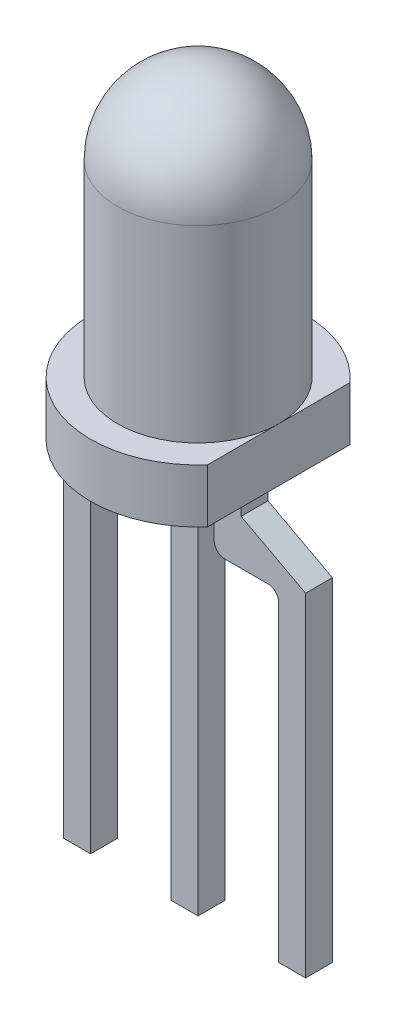
ISO-10303-21;
HEADER;
FILE_DESCRIPTION(('STEP AP214'),'2;1');
FILE_NAME('part.step','',(''),(''),'','','');
FILE_SCHEMA(('AUTOMOTIVE_DESIGN { 1 0 10303 214 1 1 1 1 }'));
ENDSEC;
DATA;
#1=APPLICATION_CONTEXT('core data for automotive mechanical design processes');
#2=APPLICATION_PROTOCOL_DEFINITION('international standard','automotive_design',2000,#1);
#3=PRODUCT_CONTEXT('',#1,'mechanical');
#4=PRODUCT('Part','Part','',(#3));
#5=PRODUCT_RELATED_PRODUCT_CATEGORY('part','',(#4));
#6=PRODUCT_DEFINITION_FORMATION('','',#4);
#7=PRODUCT_DEFINITION_CONTEXT('part definition',#1,'design');
#8=PRODUCT_DEFINITION('design','',#6,#7);
#9=PRODUCT_DEFINITION_SHAPE('','',#8);
#10=(LENGTH_UNIT() NAMED_UNIT(*) SI_UNIT(.MILLI.,.METRE.));
#11=(NAMED_UNIT(*) PLANE_ANGLE_UNIT() SI_UNIT($,.RADIAN.));
#12=(NAMED_UNIT(*) SI_UNIT($,.STERADIAN.) SOLID_ANGLE_UNIT());
#13=UNCERTAINTY_MEASURE_WITH_UNIT(LENGTH_MEASURE(1.E-05),#10,'distance_accuracy_value','');
#14=(GEOMETRIC_REPRESENTATION_CONTEXT(3) GLOBAL_UNCERTAINTY_ASSIGNED_CONTEXT((#13)) GLOBAL_UNIT_ASSIGNED_CONTEXT((#10,
#11,#12)) REPRESENTATION_CONTEXT('',''));
#15=CARTESIAN_POINT('',(0.,0.,0.));
#16=DIRECTION('',(0.,0.,1.));
#17=DIRECTION('',(1.,0.,0.));
#18=AXIS2_PLACEMENT_3D('',#15,#16,#17);
#19=CARTESIAN_POINT('',(0.,4.43,0.));
#20=DIRECTION('',(0.,1.,0.));
#21=DIRECTION('',(0.,0.,1.));
#22=AXIS2_PLACEMENT_3D('',#19,#20,#21);
#23=PLANE('',#22);
#24=DIRECTION('',(0.,0.,-1.));
#25=VECTOR('',#24,1.);
#26=CARTESIAN_POINT('',(1.5,4.43,-1.32287565553229));
#27=LINE('',#26,#25);
#28=CARTESIAN_POINT('',(1.5,4.43,1.32287565553229));
#29=VERTEX_POINT('',#28);
#30=CARTESIAN_POINT('',(1.5,4.43,0.));
#31=VERTEX_POINT('',#30);
#32=EDGE_CURVE('E410',#29,#31,#27,.T.);
#33=ORIENTED_EDGE('',*,*,#32,.T.);
#34=CARTESIAN_POINT('',(0.,4.43,0.));
#35=DIRECTION('',(0.,-1.,0.));
#36=DIRECTION('',(0.,0.,-1.));
#37=AXIS2_PLACEMENT_3D('',#34,#35,#36);
#38=CIRCLE('',#37,1.5);
#39=EDGE_CURVE('E47',#31,#31,#38,.T.);
#40=ORIENTED_EDGE('',*,*,#39,.T.);
#41=CARTESIAN_POINT('',(1.5,4.43,-1.32287565553229));
#42=VERTEX_POINT('',#41);
#43=EDGE_CURVE('E408',#31,#42,#27,.T.);
#44=ORIENTED_EDGE('',*,*,#43,.T.);
#45=CARTESIAN_POINT('',(0.,4.43,0.));
#46=DIRECTION('',(0.,1.,0.));
#47=DIRECTION('',(0.,0.,1.));
#48=AXIS2_PLACEMENT_3D('',#45,#46,#47);
#49=CIRCLE('',#48,2.);
#50=EDGE_CURVE('E405',#42,#29,#49,.T.);
#51=ORIENTED_EDGE('',*,*,#50,.T.);
#52=EDGE_LOOP('',(#33,#40,#44,#51));
#53=FACE_BOUND('',#52,.T.);
#54=ADVANCED_FACE('F32',(#53),#23,.T.);
#55=CARTESIAN_POINT('',(0.250000000000001,-4.,-0.249999999999998));
#56=DIRECTION('',(1.,0.,0.));
#57=DIRECTION('',(0.,0.,-1.));
#58=AXIS2_PLACEMENT_3D('',#55,#56,#57);
#59=PLANE('',#58);
#60=DIRECTION('',(0.,1.,0.));
#61=VECTOR('',#60,1.);
#62=CARTESIAN_POINT('',(0.250000000000001,-4.,-0.249999999999998));
#63=LINE('',#62,#61);
#64=CARTESIAN_POINT('',(0.250000000000001,-4.,-0.249999999999998));
#65=VERTEX_POINT('',#64);
#66=CARTESIAN_POINT('',(0.250000000000002,3.43,-0.249999999999998));
#67=VERTEX_POINT('',#66);
#68=EDGE_CURVE('E36',#65,#67,#63,.T.);
#69=ORIENTED_EDGE('',*,*,#68,.T.);
#70=DIRECTION('',(0.,0.,1.));
#71=VECTOR('',#70,1.);
#72=CARTESIAN_POINT('',(0.250000000000002,3.43,-3.2156196654325));
#73=LINE('',#72,#71);
#74=CARTESIAN_POINT('',(0.250000000000002,3.43,0.250000000000003));
#75=VERTEX_POINT('',#74);
#76=EDGE_CURVE('E425',#67,#75,#73,.T.);
#77=ORIENTED_EDGE('',*,*,#76,.T.);
#78=DIRECTION('',(0.,1.,0.));
#79=VECTOR('',#78,1.);
#80=CARTESIAN_POINT('',(0.250000000000002,-4.,0.250000000000003));
#81=LINE('',#80,#79);
#82=CARTESIAN_POINT('',(0.250000000000002,-4.,0.250000000000003));
#83=VERTEX_POINT('',#82);
#84=EDGE_CURVE('E11',#83,#75,#81,.T.);
#85=ORIENTED_EDGE('',*,*,#84,.F.);
#86=DIRECTION('',(0.,0.,-1.));
#87=VECTOR('',#86,1.);
#88=CARTESIAN_POINT('',(0.250000000000001,-4.,-0.249999999999998));
#89=LINE('',#88,#87);
#90=EDGE_CURVE('E432',#83,#65,#89,.T.);
#91=ORIENTED_EDGE('',*,*,#90,.T.);
#92=EDGE_LOOP('',(#69,#77,#85,#91));
#93=FACE_BOUND('',#92,.T.);
#94=ADVANCED_FACE('F34',(#93),#59,.T.);
#95=CARTESIAN_POINT('',(-0.249999999999998,-4.,0.250000000000003));
#96=DIRECTION('',(0.,0.,1.));
#97=DIRECTION('',(1.,0.,0.));
#98=AXIS2_PLACEMENT_3D('',#95,#96,#97);
#99=PLANE('',#98);
#100=ORIENTED_EDGE('',*,*,#84,.T.);
#101=DIRECTION('',(-1.,0.,0.));
#102=VECTOR('',#101,1.);
#103=CARTESIAN_POINT('',(-0.249999999999998,3.43,0.250000000000003));
#104=LINE('',#103,#102);
#105=CARTESIAN_POINT('',(-0.249999999999998,3.43,0.250000000000003));
#106=VERTEX_POINT('',#105);
#107=EDGE_CURVE('E422',#75,#106,#104,.T.);
#108=ORIENTED_EDGE('',*,*,#107,.T.);
#109=DIRECTION('',(0.,1.,0.));
#110=VECTOR('',#109,1.);
#111=CARTESIAN_POINT('',(-0.249999999999998,-4.,0.250000000000003));
#112=LINE('',#111,#110);
#113=CARTESIAN_POINT('',(-0.249999999999998,-4.,0.250000000000003));
#114=VERTEX_POINT('',#113);
#115=EDGE_CURVE('E41',#114,#106,#112,.T.);
#116=ORIENTED_EDGE('',*,*,#115,.F.);
#117=DIRECTION('',(1.,0.,0.));
#118=VECTOR('',#117,1.);
#119=CARTESIAN_POINT('',(-0.249999999999998,-4.,0.250000000000003));
#120=LINE('',#119,#118);
#121=EDGE_CURVE('E443',#114,#83,#120,.T.);
#122=ORIENTED_EDGE('',*,*,#121,.T.);
#123=EDGE_LOOP('',(#100,#108,#116,#122));
#124=FACE_BOUND('',#123,.T.);
#125=ADVANCED_FACE('F460',(#124),#99,.T.);
#126=CARTESIAN_POINT('',(-0.249999999999999,-4.,-0.249999999999998));
#127=DIRECTION('',(-1.,0.,0.));
#128=DIRECTION('',(0.,0.,1.));
#129=AXIS2_PLACEMENT_3D('',#126,#127,#128);
#130=PLANE('',#129);
#131=ORIENTED_EDGE('',*,*,#115,.T.);
#132=DIRECTION('',(0.,0.,1.));
#133=VECTOR('',#132,1.);
#134=CARTESIAN_POINT('',(-0.249999999999998,3.43,-3.2156196654325));
#135=LINE('',#134,#133);
#136=CARTESIAN_POINT('',(-0.249999999999999,3.43,-0.249999999999998));
#137=VERTEX_POINT('',#136);
#138=EDGE_CURVE('E429',#137,#106,#135,.T.);
#139=ORIENTED_EDGE('',*,*,#138,.F.);
#140=DIRECTION('',(0.,1.,0.));
#141=VECTOR('',#140,1.);
#142=CARTESIAN_POINT('',(-0.249999999999999,-4.,-0.249999999999998));
#143=LINE('',#142,#141);
#144=CARTESIAN_POINT('',(-0.249999999999999,-4.,-0.249999999999998));
#145=VERTEX_POINT('',#144);
#146=EDGE_CURVE('E446',#145,#137,#143,.T.);
#147=ORIENTED_EDGE('',*,*,#146,.F.);
#148=DIRECTION('',(0.,0.,1.));
#149=VECTOR('',#148,1.);
#150=CARTESIAN_POINT('',(-0.249999999999999,-4.,-0.249999999999998));
#151=LINE('',#150,#149);
#152=EDGE_CURVE('E440',#145,#114,#151,.T.);
#153=ORIENTED_EDGE('',*,*,#152,.T.);
#154=EDGE_LOOP('',(#131,#139,#147,#153));
#155=FACE_BOUND('',#154,.T.);
#156=ADVANCED_FACE('F466',(#155),#130,.T.);
#157=CARTESIAN_POINT('',(-0.249999999999999,-4.,-0.249999999999998));
#158=DIRECTION('',(0.,0.,-1.));
#159=DIRECTION('',(-1.,0.,0.));
#160=AXIS2_PLACEMENT_3D('',#157,#158,#159);
#161=PLANE('',#160);
#162=ORIENTED_EDGE('',*,*,#146,.T.);
#163=DIRECTION('',(-1.,0.,0.));
#164=VECTOR('',#163,1.);
#165=CARTESIAN_POINT('',(-0.249999999999998,3.43,-0.249999999999998));
#166=LINE('',#165,#164);
#167=EDGE_CURVE('E426',#67,#137,#166,.T.);
#168=ORIENTED_EDGE('',*,*,#167,.F.);
#169=ORIENTED_EDGE('',*,*,#68,.F.);
#170=DIRECTION('',(-1.,0.,0.));
#171=VECTOR('',#170,1.);
#172=CARTESIAN_POINT('',(-0.249999999999999,-4.,-0.249999999999998));
#173=LINE('',#172,#171);
#174=EDGE_CURVE('E437',#65,#145,#173,.T.);
#175=ORIENTED_EDGE('',*,*,#174,.T.);
#176=EDGE_LOOP('',(#162,#168,#169,#175));
#177=FACE_BOUND('',#176,.T.);
#178=ADVANCED_FACE('F455',(#177),#161,.T.);
#179=CARTESIAN_POINT('',(0.250000000000002,-4.,0.250000000000003));
#180=DIRECTION('',(0.,1.,0.));
#181=DIRECTION('',(0.,0.,1.));
#182=AXIS2_PLACEMENT_3D('',#179,#180,#181);
#183=PLANE('',#182);
#184=ORIENTED_EDGE('',*,*,#90,.F.);
#185=ORIENTED_EDGE('',*,*,#121,.F.);
#186=ORIENTED_EDGE('',*,*,#152,.F.);
#187=ORIENTED_EDGE('',*,*,#174,.F.);
#188=EDGE_LOOP('',(#184,#185,#186,#187));
#189=FACE_BOUND('',#188,.T.);
#190=ADVANCED_FACE('F463',(#189),#183,.F.);
#191=CARTESIAN_POINT('',(0.,4.43,0.));
#192=DIRECTION('',(0.,-1.,0.));
#193=DIRECTION('',(0.,0.,-1.));
#194=AXIS2_PLACEMENT_3D('',#191,#192,#193);
#195=CYLINDRICAL_SURFACE('',#194,2.);
#196=CARTESIAN_POINT('',(0.,3.43,0.));
#197=DIRECTION('',(0.,1.,0.));
#198=DIRECTION('',(0.,0.,1.));
#199=AXIS2_PLACEMENT_3D('',#196,#197,#198);
#200=CIRCLE('',#199,2.);
#201=CARTESIAN_POINT('',(1.5,3.43,-1.32287565553229));
#202=VERTEX_POINT('',#201);
#203=CARTESIAN_POINT('',(1.5,3.43,1.32287565553229));
#204=VERTEX_POINT('',#203);
#205=EDGE_CURVE('E399',#202,#204,#200,.T.);
#206=ORIENTED_EDGE('',*,*,#205,.T.);
#207=DIRECTION('',(0.,-1.,0.));
#208=VECTOR('',#207,1.);
#209=CARTESIAN_POINT('',(1.5,4.43,1.32287565553229));
#210=LINE('',#209,#208);
#211=EDGE_CURVE('E419',#29,#204,#210,.T.);
#212=ORIENTED_EDGE('',*,*,#211,.F.);
#213=ORIENTED_EDGE('',*,*,#50,.F.);
#214=DIRECTION('',(0.,-1.,0.));
#215=VECTOR('',#214,1.);
#216=CARTESIAN_POINT('',(1.5,4.43,-1.32287565553229));
#217=LINE('',#216,#215);
#218=EDGE_CURVE('E413',#42,#202,#217,.T.);
#219=ORIENTED_EDGE('',*,*,#218,.T.);
#220=EDGE_LOOP('',(#206,#212,#213,#219));
#221=FACE_BOUND('',#220,.T.);
#222=ADVANCED_FACE('F490',(#221),#195,.T.);
#223=CARTESIAN_POINT('',(1.5,4.43,-1.32287565553229));
#224=DIRECTION('',(-1.,0.,0.));
#225=DIRECTION('',(0.,0.,1.));
#226=AXIS2_PLACEMENT_3D('',#223,#224,#225);
#227=PLANE('',#226);
#228=DIRECTION('',(0.,0.,-1.));
#229=VECTOR('',#228,1.);
#230=CARTESIAN_POINT('',(1.5,3.43,-1.32287565553229));
#231=LINE('',#230,#229);
#232=EDGE_CURVE('E409',#204,#202,#231,.T.);
#233=ORIENTED_EDGE('',*,*,#232,.T.);
#234=ORIENTED_EDGE('',*,*,#218,.F.);
#235=ORIENTED_EDGE('',*,*,#43,.F.);
#236=ORIENTED_EDGE('',*,*,#32,.F.);
#237=ORIENTED_EDGE('',*,*,#211,.T.);
#238=EDGE_LOOP('',(#233,#234,#235,#236,#237));
#239=FACE_BOUND('',#238,.T.);
#240=ADVANCED_FACE('F486',(#239),#227,.F.);
#241=CARTESIAN_POINT('',(0.,3.43,0.));
#242=DIRECTION('',(0.,1.,0.));
#243=DIRECTION('',(0.,0.,1.));
#244=AXIS2_PLACEMENT_3D('',#241,#242,#243);
#245=PLANE('',#244);
#246=DIRECTION('',(-1.,0.,0.));
#247=VECTOR('',#246,1.);
#248=CARTESIAN_POINT('',(-0.55,3.43,0.250000000000003));
#249=LINE('',#248,#247);
#250=CARTESIAN_POINT('',(-0.55,3.43,0.250000000000003));
#251=VERTEX_POINT('',#250);
#252=CARTESIAN_POINT('',(-1.05,3.43,0.250000000000003));
#253=VERTEX_POINT('',#252);
#254=EDGE_CURVE('E240',#251,#253,#249,.T.);
#255=ORIENTED_EDGE('',*,*,#254,.F.);
#256=DIRECTION('',(0.,0.,1.));
#257=VECTOR('',#256,1.);
#258=CARTESIAN_POINT('',(-0.55,3.43,-3.2156196654325));
#259=LINE('',#258,#257);
#260=CARTESIAN_POINT('',(-0.55,3.43,-0.249999999999998));
#261=VERTEX_POINT('',#260);
#262=EDGE_CURVE('E273',#261,#251,#259,.T.);
#263=ORIENTED_EDGE('',*,*,#262,.F.);
#264=DIRECTION('',(-1.,0.,0.));
#265=VECTOR('',#264,1.);
#266=CARTESIAN_POINT('',(-0.55,3.43,-0.249999999999998));
#267=LINE('',#266,#265);
#268=CARTESIAN_POINT('',(-1.05,3.43,-0.249999999999998));
#269=VERTEX_POINT('',#268);
#270=EDGE_CURVE('E270',#261,#269,#267,.T.);
#271=ORIENTED_EDGE('',*,*,#270,.T.);
#272=DIRECTION('',(0.,0.,1.));
#273=VECTOR('',#272,1.);
#274=CARTESIAN_POINT('',(-1.05,3.43,-3.2156196654325));
#275=LINE('',#274,#273);
#276=EDGE_CURVE('E269',#269,#253,#275,.T.);
#277=ORIENTED_EDGE('',*,*,#276,.T.);
#278=EDGE_LOOP('',(#255,#263,#271,#277));
#279=FACE_BOUND('',#278,.T.);
#280=DIRECTION('',(-1.,0.,0.));
#281=VECTOR('',#280,1.);
#282=CARTESIAN_POINT('',(0.55,3.43,0.250000000000003));
#283=LINE('',#282,#281);
#284=CARTESIAN_POINT('',(1.05,3.43,0.250000000000003));
#285=VERTEX_POINT('',#284);
#286=CARTESIAN_POINT('',(0.55,3.43,0.250000000000003));
#287=VERTEX_POINT('',#286);
#288=EDGE_CURVE('E338',#285,#287,#283,.T.);
#289=ORIENTED_EDGE('',*,*,#288,.F.);
#290=DIRECTION('',(0.,0.,1.));
#291=VECTOR('',#290,1.);
#292=CARTESIAN_POINT('',(1.05,3.43,-3.2156196654325));
#293=LINE('',#292,#291);
#294=CARTESIAN_POINT('',(1.05,3.43,-0.249999999999998));
#295=VERTEX_POINT('',#294);
#296=EDGE_CURVE('E365',#295,#285,#293,.T.);
#297=ORIENTED_EDGE('',*,*,#296,.F.);
#298=DIRECTION('',(-1.,0.,0.));
#299=VECTOR('',#298,1.);
#300=CARTESIAN_POINT('',(0.55,3.43,-0.249999999999998));
#301=LINE('',#300,#299);
#302=CARTESIAN_POINT('',(0.55,3.43,-0.249999999999998));
#303=VERTEX_POINT('',#302);
#304=EDGE_CURVE('E362',#295,#303,#301,.T.);
#305=ORIENTED_EDGE('',*,*,#304,.T.);
#306=DIRECTION('',(0.,0.,1.));
#307=VECTOR('',#306,1.);
#308=CARTESIAN_POINT('',(0.55,3.43,-3.2156196654325));
#309=LINE('',#308,#307);
#310=EDGE_CURVE('E361',#303,#287,#309,.T.);
#311=ORIENTED_EDGE('',*,*,#310,.T.);
#312=EDGE_LOOP('',(#289,#297,#305,#311));
#313=FACE_BOUND('',#312,.T.);
#314=ORIENTED_EDGE('',*,*,#76,.F.);
#315=ORIENTED_EDGE('',*,*,#167,.T.);
#316=ORIENTED_EDGE('',*,*,#138,.T.);
#317=ORIENTED_EDGE('',*,*,#107,.F.);
#318=EDGE_LOOP('',(#314,#315,#316,#317));
#319=FACE_BOUND('',#318,.T.);
#320=ORIENTED_EDGE('',*,*,#205,.F.);
#321=ORIENTED_EDGE('',*,*,#232,.F.);
#322=EDGE_LOOP('',(#320,#321));
#323=FACE_BOUND('',#322,.T.);
#324=ADVANCED_FACE('F457',(#279,#313,#319,#323),#245,.F.);
#325=CARTESIAN_POINT('',(2.25,-4.,-0.249999999999997));
#326=DIRECTION('',(1.,0.,0.));
#327=DIRECTION('',(0.,0.,-1.));
#328=AXIS2_PLACEMENT_3D('',#325,#326,#327);
#329=PLANE('',#328);
#330=DIRECTION('',(0.,1.,0.));
#331=VECTOR('',#330,1.);
#332=CARTESIAN_POINT('',(2.25,-4.,-0.249999999999997));
#333=LINE('',#332,#331);
#334=CARTESIAN_POINT('',(2.25,-4.,-0.249999999999997));
#335=VERTEX_POINT('',#334);
#336=CARTESIAN_POINT('',(2.25,2.2,-0.249999999999998));
#337=VERTEX_POINT('',#336);
#338=EDGE_CURVE('E396',#335,#337,#333,.T.);
#339=ORIENTED_EDGE('',*,*,#338,.T.);
#340=DIRECTION('',(0.,0.,1.));
#341=VECTOR('',#340,1.);
#342=CARTESIAN_POINT('',(2.25,2.2,-3.2156196654325));
#343=LINE('',#342,#341);
#344=CARTESIAN_POINT('',(2.25,2.2,0.250000000000003));
#345=VERTEX_POINT('',#344);
#346=EDGE_CURVE('E328',#337,#345,#343,.T.);
#347=ORIENTED_EDGE('',*,*,#346,.T.);
#348=DIRECTION('',(0.,1.,0.));
#349=VECTOR('',#348,1.);
#350=CARTESIAN_POINT('',(2.25,-4.,0.250000000000003));
#351=LINE('',#350,#349);
#352=CARTESIAN_POINT('',(2.25,-4.,0.250000000000003));
#353=VERTEX_POINT('',#352);
#354=EDGE_CURVE('E397',#353,#345,#351,.T.);
#355=ORIENTED_EDGE('',*,*,#354,.F.);
#356=DIRECTION('',(0.,0.,-1.));
#357=VECTOR('',#356,1.);
#358=CARTESIAN_POINT('',(2.25,-4.,-0.249999999999997));
#359=LINE('',#358,#357);
#360=EDGE_CURVE('E375',#353,#335,#359,.T.);
#361=ORIENTED_EDGE('',*,*,#360,.T.);
#362=EDGE_LOOP('',(#339,#347,#355,#361));
#363=FACE_BOUND('',#362,.T.);
#364=ADVANCED_FACE('F482',(#363),#329,.T.);
#365=CARTESIAN_POINT('',(1.75,-4.,0.250000000000003));
#366=DIRECTION('',(0.,0.,1.));
#367=DIRECTION('',(1.,0.,0.));
#368=AXIS2_PLACEMENT_3D('',#365,#366,#367);
#369=PLANE('',#368);
#370=ORIENTED_EDGE('',*,*,#354,.T.);
#371=DIRECTION('',(-0.882760707440721,0.469822874495014,0.));
#372=VECTOR('',#371,1.);
#373=CARTESIAN_POINT('',(1.05,2.8386639602804,0.250000000000003));
#374=LINE('',#373,#372);
#375=CARTESIAN_POINT('',(1.05,2.8386639602804,0.250000000000003));
#376=VERTEX_POINT('',#375);
#377=EDGE_CURVE('E319',#345,#376,#374,.T.);
#378=ORIENTED_EDGE('',*,*,#377,.T.);
#379=DIRECTION('',(0.,1.,0.));
#380=VECTOR('',#379,1.);
#381=CARTESIAN_POINT('',(1.05,3.43,0.250000000000003));
#382=LINE('',#381,#380);
#383=EDGE_CURVE('E340',#376,#285,#382,.T.);
#384=ORIENTED_EDGE('',*,*,#383,.T.);
#385=ORIENTED_EDGE('',*,*,#288,.T.);
#386=DIRECTION('',(0.,-1.,0.));
#387=VECTOR('',#386,1.);
#388=CARTESIAN_POINT('',(0.55,2.2,0.250000000000003));
#389=LINE('',#388,#387);
#390=CARTESIAN_POINT('',(0.55,2.2,0.250000000000003));
#391=VERTEX_POINT('',#390);
#392=EDGE_CURVE('E335',#287,#391,#389,.T.);
#393=ORIENTED_EDGE('',*,*,#392,.T.);
#394=CARTESIAN_POINT('',(0.75,2.2,0.250000000000003));
#395=DIRECTION('',(0.,0.,1.));
#396=DIRECTION('',(-1.,0.,0.));
#397=AXIS2_PLACEMENT_3D('',#394,#395,#396);
#398=CIRCLE('',#397,0.2);
#399=CARTESIAN_POINT('',(0.75,2.,0.250000000000003));
#400=VERTEX_POINT('',#399);
#401=EDGE_CURVE('E332',#391,#400,#398,.T.);
#402=ORIENTED_EDGE('',*,*,#401,.T.);
#403=DIRECTION('',(1.,0.,0.));
#404=VECTOR('',#403,1.);
#405=CARTESIAN_POINT('',(1.55,2.,0.250000000000003));
#406=LINE('',#405,#404);
#407=CARTESIAN_POINT('',(1.55,2.,0.250000000000003));
#408=VERTEX_POINT('',#407);
#409=EDGE_CURVE('E329',#400,#408,#406,.T.);
#410=ORIENTED_EDGE('',*,*,#409,.T.);
#411=CARTESIAN_POINT('',(1.55,1.8,0.250000000000003));
#412=DIRECTION('',(0.,0.,-1.));
#413=DIRECTION('',(1.,0.,0.));
#414=AXIS2_PLACEMENT_3D('',#411,#412,#413);
#415=CIRCLE('',#414,0.2);
#416=CARTESIAN_POINT('',(1.75,1.8,0.250000000000003));
#417=VERTEX_POINT('',#416);
#418=EDGE_CURVE('E325',#408,#417,#415,.T.);
#419=ORIENTED_EDGE('',*,*,#418,.T.);
#420=DIRECTION('',(0.,1.,0.));
#421=VECTOR('',#420,1.);
#422=CARTESIAN_POINT('',(1.75,-4.,0.250000000000003));
#423=LINE('',#422,#421);
#424=CARTESIAN_POINT('',(1.75,-4.,0.250000000000003));
#425=VERTEX_POINT('',#424);
#426=EDGE_CURVE('E400',#425,#417,#423,.T.);
#427=ORIENTED_EDGE('',*,*,#426,.F.);
#428=DIRECTION('',(1.,0.,0.));
#429=VECTOR('',#428,1.);
#430=CARTESIAN_POINT('',(1.75,-4.,0.250000000000003));
#431=LINE('',#430,#429);
#432=EDGE_CURVE('E393',#425,#353,#431,.T.);
#433=ORIENTED_EDGE('',*,*,#432,.T.);
#434=EDGE_LOOP('',(#370,#378,#384,#385,#393,#402,#410,#419,#427,#433));
#435=FACE_BOUND('',#434,.T.);
#436=ADVANCED_FACE('F520',(#435),#369,.T.);
#437=CARTESIAN_POINT('',(1.75,-4.,-0.249999999999997));
#438=DIRECTION('',(-1.,0.,0.));
#439=DIRECTION('',(0.,0.,1.));
#440=AXIS2_PLACEMENT_3D('',#437,#438,#439);
#441=PLANE('',#440);
#442=ORIENTED_EDGE('',*,*,#426,.T.);
#443=DIRECTION('',(0.,0.,1.));
#444=VECTOR('',#443,1.);
#445=CARTESIAN_POINT('',(1.75,1.8,-3.2156196654325));
#446=LINE('',#445,#444);
#447=CARTESIAN_POINT('',(1.75,1.8,-0.249999999999998));
#448=VERTEX_POINT('',#447);
#449=EDGE_CURVE('E348',#448,#417,#446,.T.);
#450=ORIENTED_EDGE('',*,*,#449,.F.);
#451=DIRECTION('',(0.,1.,0.));
#452=VECTOR('',#451,1.);
#453=CARTESIAN_POINT('',(1.75,-4.,-0.249999999999997));
#454=LINE('',#453,#452);
#455=CARTESIAN_POINT('',(1.75,-4.,-0.249999999999997));
#456=VERTEX_POINT('',#455);
#457=EDGE_CURVE('E402',#456,#448,#454,.T.);
#458=ORIENTED_EDGE('',*,*,#457,.F.);
#459=DIRECTION('',(0.,0.,1.));
#460=VECTOR('',#459,1.);
#461=CARTESIAN_POINT('',(1.75,-4.,-0.249999999999997));
#462=LINE('',#461,#460);
#463=EDGE_CURVE('E390',#456,#425,#462,.T.);
#464=ORIENTED_EDGE('',*,*,#463,.T.);
#465=EDGE_LOOP('',(#442,#450,#458,#464));
#466=FACE_BOUND('',#465,.T.);
#467=ADVANCED_FACE('F527',(#466),#441,.T.);
#468=CARTESIAN_POINT('',(1.75,-4.,-0.249999999999997));
#469=DIRECTION('',(0.,0.,-1.));
#470=DIRECTION('',(-1.,0.,0.));
#471=AXIS2_PLACEMENT_3D('',#468,#469,#470);
#472=PLANE('',#471);
#473=ORIENTED_EDGE('',*,*,#457,.T.);
#474=CARTESIAN_POINT('',(1.55,1.8,-0.249999999999998));
#475=DIRECTION('',(0.,0.,-1.));
#476=DIRECTION('',(-1.,0.,0.));
#477=AXIS2_PLACEMENT_3D('',#474,#475,#476);
#478=CIRCLE('',#477,0.2);
#479=CARTESIAN_POINT('',(1.55,2.,-0.249999999999998));
#480=VERTEX_POINT('',#479);
#481=EDGE_CURVE('E345',#480,#448,#478,.T.);
#482=ORIENTED_EDGE('',*,*,#481,.F.);
#483=DIRECTION('',(1.,0.,0.));
#484=VECTOR('',#483,1.);
#485=CARTESIAN_POINT('',(1.55,2.,-0.249999999999998));
#486=LINE('',#485,#484);
#487=CARTESIAN_POINT('',(0.75,2.,-0.249999999999998));
#488=VERTEX_POINT('',#487);
#489=EDGE_CURVE('E350',#488,#480,#486,.T.);
#490=ORIENTED_EDGE('',*,*,#489,.F.);
#491=CARTESIAN_POINT('',(0.75,2.2,-0.249999999999998));
#492=DIRECTION('',(0.,0.,-1.));
#493=DIRECTION('',(-1.,0.,0.));
#494=AXIS2_PLACEMENT_3D('',#491,#492,#493);
#495=CIRCLE('',#494,0.2);
#496=CARTESIAN_POINT('',(0.55,2.2,-0.249999999999998));
#497=VERTEX_POINT('',#496);
#498=EDGE_CURVE('E354',#497,#488,#495,.F.);
#499=ORIENTED_EDGE('',*,*,#498,.F.);
#500=DIRECTION('',(0.,-1.,0.));
#501=VECTOR('',#500,1.);
#502=CARTESIAN_POINT('',(0.55,2.2,-0.249999999999998));
#503=LINE('',#502,#501);
#504=EDGE_CURVE('E358',#303,#497,#503,.T.);
#505=ORIENTED_EDGE('',*,*,#504,.F.);
#506=ORIENTED_EDGE('',*,*,#304,.F.);
#507=DIRECTION('',(0.,1.,0.));
#508=VECTOR('',#507,1.);
#509=CARTESIAN_POINT('',(1.05,3.43,-0.249999999999998));
#510=LINE('',#509,#508);
#511=CARTESIAN_POINT('',(1.05,2.8386639602804,-0.249999999999998));
#512=VERTEX_POINT('',#511);
#513=EDGE_CURVE('E366',#512,#295,#510,.T.);
#514=ORIENTED_EDGE('',*,*,#513,.F.);
#515=DIRECTION('',(-0.882760707440721,0.469822874495014,0.));
#516=VECTOR('',#515,1.);
#517=CARTESIAN_POINT('',(1.05,2.8386639602804,-0.249999999999998));
#518=LINE('',#517,#516);
#519=EDGE_CURVE('E370',#337,#512,#518,.T.);
#520=ORIENTED_EDGE('',*,*,#519,.F.);
#521=ORIENTED_EDGE('',*,*,#338,.F.);
#522=DIRECTION('',(-1.,0.,0.));
#523=VECTOR('',#522,1.);
#524=CARTESIAN_POINT('',(1.75,-4.,-0.249999999999997));
#525=LINE('',#524,#523);
#526=EDGE_CURVE('E387',#335,#456,#525,.T.);
#527=ORIENTED_EDGE('',*,*,#526,.T.);
#528=EDGE_LOOP('',(#473,#482,#490,#499,#505,#506,#514,#520,#521,#527));
#529=FACE_BOUND('',#528,.T.);
#530=ADVANCED_FACE('F535',(#529),#472,.T.);
#531=CARTESIAN_POINT('',(2.25,-4.,0.250000000000003));
#532=DIRECTION('',(0.,1.,0.));
#533=DIRECTION('',(0.,0.,1.));
#534=AXIS2_PLACEMENT_3D('',#531,#532,#533);
#535=PLANE('',#534);
#536=ORIENTED_EDGE('',*,*,#360,.F.);
#537=ORIENTED_EDGE('',*,*,#432,.F.);
#538=ORIENTED_EDGE('',*,*,#463,.F.);
#539=ORIENTED_EDGE('',*,*,#526,.F.);
#540=EDGE_LOOP('',(#536,#537,#538,#539));
#541=FACE_BOUND('',#540,.T.);
#542=ADVANCED_FACE('F543',(#541),#535,.F.);
#543=CARTESIAN_POINT('',(1.05,2.8386639602804,-3.2156196654325));
#544=DIRECTION('',(0.469822874495014,0.882760707440721,0.));
#545=DIRECTION('',(-0.882760707440721,0.469822874495014,0.));
#546=AXIS2_PLACEMENT_3D('',#543,#544,#545);
#547=PLANE('',#546);
#548=ORIENTED_EDGE('',*,*,#346,.F.);
#549=ORIENTED_EDGE('',*,*,#519,.T.);
#550=DIRECTION('',(0.,0.,1.));
#551=VECTOR('',#550,1.);
#552=CARTESIAN_POINT('',(1.05,2.8386639602804,-3.2156196654325));
#553=LINE('',#552,#551);
#554=EDGE_CURVE('E369',#512,#376,#553,.T.);
#555=ORIENTED_EDGE('',*,*,#554,.T.);
#556=ORIENTED_EDGE('',*,*,#377,.F.);
#557=EDGE_LOOP('',(#548,#549,#555,#556));
#558=FACE_BOUND('',#557,.T.);
#559=ADVANCED_FACE('F550',(#558),#547,.T.);
#560=CARTESIAN_POINT('',(1.05,3.43,-3.2156196654325));
#561=DIRECTION('',(1.,0.,0.));
#562=DIRECTION('',(0.,1.,0.));
#563=AXIS2_PLACEMENT_3D('',#560,#561,#562);
#564=PLANE('',#563);
#565=ORIENTED_EDGE('',*,*,#554,.F.);
#566=ORIENTED_EDGE('',*,*,#513,.T.);
#567=ORIENTED_EDGE('',*,*,#296,.T.);
#568=ORIENTED_EDGE('',*,*,#383,.F.);
#569=EDGE_LOOP('',(#565,#566,#567,#568));
#570=FACE_BOUND('',#569,.T.);
#571=ADVANCED_FACE('F558',(#570),#564,.T.);
#572=CARTESIAN_POINT('',(0.55,2.2,-3.2156196654325));
#573=DIRECTION('',(-1.,0.,0.));
#574=DIRECTION('',(0.,0.,1.));
#575=AXIS2_PLACEMENT_3D('',#572,#573,#574);
#576=PLANE('',#575);
#577=ORIENTED_EDGE('',*,*,#310,.F.);
#578=ORIENTED_EDGE('',*,*,#504,.T.);
#579=DIRECTION('',(0.,0.,1.));
#580=VECTOR('',#579,1.);
#581=CARTESIAN_POINT('',(0.55,2.2,-3.2156196654325));
#582=LINE('',#581,#580);
#583=EDGE_CURVE('E357',#497,#391,#582,.T.);
#584=ORIENTED_EDGE('',*,*,#583,.T.);
#585=ORIENTED_EDGE('',*,*,#392,.F.);
#586=EDGE_LOOP('',(#577,#578,#584,#585));
#587=FACE_BOUND('',#586,.T.);
#588=ADVANCED_FACE('F566',(#587),#576,.T.);
#589=CARTESIAN_POINT('',(0.75,2.2,-3.2156196654325));
#590=DIRECTION('',(0.,0.,1.));
#591=DIRECTION('',(1.,0.,0.));
#592=AXIS2_PLACEMENT_3D('',#589,#590,#591);
#593=CYLINDRICAL_SURFACE('',#592,0.2);
#594=ORIENTED_EDGE('',*,*,#583,.F.);
#595=ORIENTED_EDGE('',*,*,#498,.T.);
#596=DIRECTION('',(0.,0.,1.));
#597=VECTOR('',#596,1.);
#598=CARTESIAN_POINT('',(0.75,2.,-3.2156196654325));
#599=LINE('',#598,#597);
#600=EDGE_CURVE('E353',#488,#400,#599,.T.);
#601=ORIENTED_EDGE('',*,*,#600,.T.);
#602=ORIENTED_EDGE('',*,*,#401,.F.);
#603=EDGE_LOOP('',(#594,#595,#601,#602));
#604=FACE_BOUND('',#603,.T.);
#605=ADVANCED_FACE('F574',(#604),#593,.T.);
#606=CARTESIAN_POINT('',(1.55,2.,-3.2156196654325));
#607=DIRECTION('',(0.,-1.,0.));
#608=DIRECTION('',(0.,0.,-1.));
#609=AXIS2_PLACEMENT_3D('',#606,#607,#608);
#610=PLANE('',#609);
#611=ORIENTED_EDGE('',*,*,#600,.F.);
#612=ORIENTED_EDGE('',*,*,#489,.T.);
#613=DIRECTION('',(0.,0.,1.));
#614=VECTOR('',#613,1.);
#615=CARTESIAN_POINT('',(1.55,2.,-3.2156196654325));
#616=LINE('',#615,#614);
#617=EDGE_CURVE('E349',#480,#408,#616,.T.);
#618=ORIENTED_EDGE('',*,*,#617,.T.);
#619=ORIENTED_EDGE('',*,*,#409,.F.);
#620=EDGE_LOOP('',(#611,#612,#618,#619));
#621=FACE_BOUND('',#620,.T.);
#622=ADVANCED_FACE('F582',(#621),#610,.T.);
#623=CARTESIAN_POINT('',(1.55,1.8,-3.2156196654325));
#624=DIRECTION('',(0.,0.,1.));
#625=DIRECTION('',(1.,0.,0.));
#626=AXIS2_PLACEMENT_3D('',#623,#624,#625);
#627=CYLINDRICAL_SURFACE('',#626,0.2);
#628=ORIENTED_EDGE('',*,*,#617,.F.);
#629=ORIENTED_EDGE('',*,*,#481,.T.);
#630=ORIENTED_EDGE('',*,*,#449,.T.);
#631=ORIENTED_EDGE('',*,*,#418,.F.);
#632=EDGE_LOOP('',(#628,#629,#630,#631));
#633=FACE_BOUND('',#632,.T.);
#634=ADVANCED_FACE('F590',(#633),#627,.F.);
#635=CARTESIAN_POINT('',(-1.75,-4.,-0.249999999999997));
#636=DIRECTION('',(1.,0.,0.));
#637=DIRECTION('',(0.,0.,-1.));
#638=AXIS2_PLACEMENT_3D('',#635,#636,#637);
#639=PLANE('',#638);
#640=DIRECTION('',(0.,1.,0.));
#641=VECTOR('',#640,1.);
#642=CARTESIAN_POINT('',(-1.75,-4.,-0.249999999999997));
#643=LINE('',#642,#641);
#644=CARTESIAN_POINT('',(-1.75,-4.,-0.249999999999997));
#645=VERTEX_POINT('',#644);
#646=CARTESIAN_POINT('',(-1.75,1.8,-0.249999999999998));
#647=VERTEX_POINT('',#646);
#648=EDGE_CURVE('E316',#645,#647,#643,.T.);
#649=ORIENTED_EDGE('',*,*,#648,.T.);
#650=DIRECTION('',(0.,0.,1.));
#651=VECTOR('',#650,1.);
#652=CARTESIAN_POINT('',(-1.75,1.8,-3.2156196654325));
#653=LINE('',#652,#651);
#654=CARTESIAN_POINT('',(-1.75,1.8,0.250000000000003));
#655=VERTEX_POINT('',#654);
#656=EDGE_CURVE('E242',#647,#655,#653,.T.);
#657=ORIENTED_EDGE('',*,*,#656,.T.);
#658=DIRECTION('',(0.,1.,0.));
#659=VECTOR('',#658,1.);
#660=CARTESIAN_POINT('',(-1.75,-4.,0.250000000000004));
#661=LINE('',#660,#659);
#662=CARTESIAN_POINT('',(-1.75,-4.,0.250000000000004));
#663=VERTEX_POINT('',#662);
#664=EDGE_CURVE('E317',#663,#655,#661,.T.);
#665=ORIENTED_EDGE('',*,*,#664,.F.);
#666=DIRECTION('',(0.,0.,-1.));
#667=VECTOR('',#666,1.);
#668=CARTESIAN_POINT('',(-1.75,-4.,-0.249999999999997));
#669=LINE('',#668,#667);
#670=EDGE_CURVE('E304',#663,#645,#669,.T.);
#671=ORIENTED_EDGE('',*,*,#670,.T.);
#672=EDGE_LOOP('',(#649,#657,#665,#671));
#673=FACE_BOUND('',#672,.T.);
#674=ADVANCED_FACE('F598',(#673),#639,.T.);
#675=CARTESIAN_POINT('',(-1.75,-4.,0.250000000000004));
#676=DIRECTION('',(0.,0.,1.));
#677=DIRECTION('',(1.,0.,0.));
#678=AXIS2_PLACEMENT_3D('',#675,#676,#677);
#679=PLANE('',#678);
#680=ORIENTED_EDGE('',*,*,#664,.T.);
#681=CARTESIAN_POINT('',(-1.55,1.8,0.250000000000003));
#682=DIRECTION('',(0.,0.,-1.));
#683=DIRECTION('',(1.,0.,0.));
#684=AXIS2_PLACEMENT_3D('',#681,#682,#683);
#685=CIRCLE('',#684,0.2);
#686=CARTESIAN_POINT('',(-1.55,2.,0.250000000000003));
#687=VERTEX_POINT('',#686);
#688=EDGE_CURVE('E235',#655,#687,#685,.T.);
#689=ORIENTED_EDGE('',*,*,#688,.T.);
#690=DIRECTION('',(1.,0.,0.));
#691=VECTOR('',#690,1.);
#692=CARTESIAN_POINT('',(-1.55,2.,0.250000000000003));
#693=LINE('',#692,#691);
#694=CARTESIAN_POINT('',(-0.867667764204726,2.,0.250000000000003));
#695=VERTEX_POINT('',#694);
#696=EDGE_CURVE('E262',#687,#695,#693,.T.);
#697=ORIENTED_EDGE('',*,*,#696,.T.);
#698=CARTESIAN_POINT('',(-0.867667764204726,2.2,0.250000000000003));
#699=DIRECTION('',(0.,0.,1.));
#700=DIRECTION('',(-1.,0.,0.));
#701=AXIS2_PLACEMENT_3D('',#698,#699,#700);
#702=CIRCLE('',#701,0.2);
#703=CARTESIAN_POINT('',(-0.667667764204726,2.2,0.250000000000003));
#704=VERTEX_POINT('',#703);
#705=EDGE_CURVE('E259',#695,#704,#702,.T.);
#706=ORIENTED_EDGE('',*,*,#705,.T.);
#707=DIRECTION('',(0.,1.,0.));
#708=VECTOR('',#707,1.);
#709=CARTESIAN_POINT('',(-0.667667764204726,2.37687985931471,0.250000000000003));
#710=LINE('',#709,#708);
#711=CARTESIAN_POINT('',(-0.667667764204726,2.37687985931471,0.250000000000003));
#712=VERTEX_POINT('',#711);
#713=EDGE_CURVE('E256',#704,#712,#710,.T.);
#714=ORIENTED_EDGE('',*,*,#713,.T.);
#715=DIRECTION('',(0.754358024509842,0.656463228869377,0.));
#716=VECTOR('',#715,1.);
#717=CARTESIAN_POINT('',(-0.55,2.47927760403794,0.250000000000003));
#718=LINE('',#717,#716);
#719=CARTESIAN_POINT('',(-0.55,2.47927760403794,0.250000000000003));
#720=VERTEX_POINT('',#719);
#721=EDGE_CURVE('E253',#712,#720,#718,.T.);
#722=ORIENTED_EDGE('',*,*,#721,.T.);
#723=DIRECTION('',(0.,1.,0.));
#724=VECTOR('',#723,1.);
#725=CARTESIAN_POINT('',(-0.55,2.47927760403794,0.250000000000003));
#726=LINE('',#725,#724);
#727=EDGE_CURVE('E247',#720,#251,#726,.T.);
#728=ORIENTED_EDGE('',*,*,#727,.T.);
#729=ORIENTED_EDGE('',*,*,#254,.T.);
#730=DIRECTION('',(0.,-1.,0.));
#731=VECTOR('',#730,1.);
#732=CARTESIAN_POINT('',(-1.05,3.43,0.250000000000003));
#733=LINE('',#732,#731);
#734=CARTESIAN_POINT('',(-1.05,2.8386639602804,0.250000000000003));
#735=VERTEX_POINT('',#734);
#736=EDGE_CURVE('E54',#253,#735,#733,.T.);
#737=ORIENTED_EDGE('',*,*,#736,.T.);
#738=DIRECTION('',(-0.882760707440721,-0.469822874495014,0.));
#739=VECTOR('',#738,1.);
#740=CARTESIAN_POINT('',(-1.05,2.8386639602804,0.250000000000003));
#741=LINE('',#740,#739);
#742=CARTESIAN_POINT('',(-2.25,2.2,0.250000000000003));
#743=VERTEX_POINT('',#742);
#744=EDGE_CURVE('E230',#735,#743,#741,.T.);
#745=ORIENTED_EDGE('',*,*,#744,.T.);
#746=DIRECTION('',(0.,1.,0.));
#747=VECTOR('',#746,1.);
#748=CARTESIAN_POINT('',(-2.25,-4.,0.250000000000004));
#749=LINE('',#748,#747);
#750=CARTESIAN_POINT('',(-2.25,-4.,0.250000000000004));
#751=VERTEX_POINT('',#750);
#752=EDGE_CURVE('E320',#751,#743,#749,.T.);
#753=ORIENTED_EDGE('',*,*,#752,.F.);
#754=DIRECTION('',(1.,0.,0.));
#755=VECTOR('',#754,1.);
#756=CARTESIAN_POINT('',(-1.75,-4.,0.250000000000004));
#757=LINE('',#756,#755);
#758=EDGE_CURVE('E313',#751,#663,#757,.T.);
#759=ORIENTED_EDGE('',*,*,#758,.T.);
#760=EDGE_LOOP('',(#680,#689,#697,#706,#714,#722,#728,#729,#737,#745,#753,#759));
#761=FACE_BOUND('',#760,.T.);
#762=ADVANCED_FACE('F237',(#761),#679,.T.);
#763=CARTESIAN_POINT('',(-2.25,-4.,-0.249999999999996));
#764=DIRECTION('',(-1.,0.,0.));
#765=DIRECTION('',(0.,0.,1.));
#766=AXIS2_PLACEMENT_3D('',#763,#764,#765);
#767=PLANE('',#766);
#768=ORIENTED_EDGE('',*,*,#752,.T.);
#769=DIRECTION('',(0.,0.,1.));
#770=VECTOR('',#769,1.);
#771=CARTESIAN_POINT('',(-2.25,2.2,-3.2156196654325));
#772=LINE('',#771,#770);
#773=CARTESIAN_POINT('',(-2.25,2.2,-0.249999999999998));
#774=VERTEX_POINT('',#773);
#775=EDGE_CURVE('E233',#774,#743,#772,.T.);
#776=ORIENTED_EDGE('',*,*,#775,.F.);
#777=DIRECTION('',(0.,1.,0.));
#778=VECTOR('',#777,1.);
#779=CARTESIAN_POINT('',(-2.25,-4.,-0.249999999999996));
#780=LINE('',#779,#778);
#781=CARTESIAN_POINT('',(-2.25,-4.,-0.249999999999996));
#782=VERTEX_POINT('',#781);
#783=EDGE_CURVE('E322',#782,#774,#780,.T.);
#784=ORIENTED_EDGE('',*,*,#783,.F.);
#785=DIRECTION('',(0.,0.,1.));
#786=VECTOR('',#785,1.);
#787=CARTESIAN_POINT('',(-2.25,-4.,-0.249999999999996));
#788=LINE('',#787,#786);
#789=EDGE_CURVE('E310',#782,#751,#788,.T.);
#790=ORIENTED_EDGE('',*,*,#789,.T.);
#791=EDGE_LOOP('',(#768,#776,#784,#790));
#792=FACE_BOUND('',#791,.T.);
#793=ADVANCED_FACE('F613',(#792),#767,.T.);
#794=CARTESIAN_POINT('',(-1.75,-4.,-0.249999999999997));
#795=DIRECTION('',(0.,0.,-1.));
#796=DIRECTION('',(-1.,0.,0.));
#797=AXIS2_PLACEMENT_3D('',#794,#795,#796);
#798=PLANE('',#797);
#799=ORIENTED_EDGE('',*,*,#783,.T.);
#800=DIRECTION('',(-0.882760707440721,-0.469822874495014,0.));
#801=VECTOR('',#800,1.);
#802=CARTESIAN_POINT('',(-1.05,2.8386639602804,-0.249999999999998));
#803=LINE('',#802,#801);
#804=CARTESIAN_POINT('',(-1.05,2.8386639602804,-0.249999999999998));
#805=VERTEX_POINT('',#804);
#806=EDGE_CURVE('E226',#805,#774,#803,.T.);
#807=ORIENTED_EDGE('',*,*,#806,.F.);
#808=DIRECTION('',(0.,-1.,0.));
#809=VECTOR('',#808,1.);
#810=CARTESIAN_POINT('',(-1.05,3.43,-0.249999999999998));
#811=LINE('',#810,#809);
#812=EDGE_CURVE('E223',#269,#805,#811,.T.);
#813=ORIENTED_EDGE('',*,*,#812,.F.);
#814=ORIENTED_EDGE('',*,*,#270,.F.);
#815=DIRECTION('',(0.,1.,0.));
#816=VECTOR('',#815,1.);
#817=CARTESIAN_POINT('',(-0.55,2.47927760403794,-0.249999999999998));
#818=LINE('',#817,#816);
#819=CARTESIAN_POINT('',(-0.55,2.47927760403794,-0.249999999999998));
#820=VERTEX_POINT('',#819);
#821=EDGE_CURVE('E274',#820,#261,#818,.T.);
#822=ORIENTED_EDGE('',*,*,#821,.F.);
#823=DIRECTION('',(0.754358024509842,0.656463228869377,0.));
#824=VECTOR('',#823,1.);
#825=CARTESIAN_POINT('',(-0.55,2.47927760403794,-0.249999999999998));
#826=LINE('',#825,#824);
#827=CARTESIAN_POINT('',(-0.667667764204726,2.37687985931471,-0.249999999999998));
#828=VERTEX_POINT('',#827);
#829=EDGE_CURVE('E278',#828,#820,#826,.T.);
#830=ORIENTED_EDGE('',*,*,#829,.F.);
#831=DIRECTION('',(0.,1.,0.));
#832=VECTOR('',#831,1.);
#833=CARTESIAN_POINT('',(-0.667667764204726,2.37687985931471,-0.249999999999998));
#834=LINE('',#833,#832);
#835=CARTESIAN_POINT('',(-0.667667764204726,2.2,-0.249999999999998));
#836=VERTEX_POINT('',#835);
#837=EDGE_CURVE('E282',#836,#828,#834,.T.);
#838=ORIENTED_EDGE('',*,*,#837,.F.);
#839=CARTESIAN_POINT('',(-0.867667764204726,2.2,-0.249999999999998));
#840=DIRECTION('',(0.,0.,-1.));
#841=DIRECTION('',(-1.,0.,0.));
#842=AXIS2_PLACEMENT_3D('',#839,#840,#841);
#843=CIRCLE('',#842,0.2);
#844=CARTESIAN_POINT('',(-0.867667764204726,2.,-0.249999999999998));
#845=VERTEX_POINT('',#844);
#846=EDGE_CURVE('E286',#845,#836,#843,.F.);
#847=ORIENTED_EDGE('',*,*,#846,.F.);
#848=DIRECTION('',(1.,0.,0.));
#849=VECTOR('',#848,1.);
#850=CARTESIAN_POINT('',(-1.55,2.,-0.249999999999998));
#851=LINE('',#850,#849);
#852=CARTESIAN_POINT('',(-1.55,2.,-0.249999999999998));
#853=VERTEX_POINT('',#852);
#854=EDGE_CURVE('E290',#853,#845,#851,.T.);
#855=ORIENTED_EDGE('',*,*,#854,.F.);
#856=CARTESIAN_POINT('',(-1.55,1.8,-0.249999999999998));
#857=DIRECTION('',(0.,0.,-1.));
#858=DIRECTION('',(-1.,0.,0.));
#859=AXIS2_PLACEMENT_3D('',#856,#857,#858);
#860=CIRCLE('',#859,0.2);
#861=EDGE_CURVE('E245',#647,#853,#860,.T.);
#862=ORIENTED_EDGE('',*,*,#861,.F.);
#863=ORIENTED_EDGE('',*,*,#648,.F.);
#864=DIRECTION('',(-1.,0.,0.));
#865=VECTOR('',#864,1.);
#866=CARTESIAN_POINT('',(-1.75,-4.,-0.249999999999997));
#867=LINE('',#866,#865);
#868=EDGE_CURVE('E307',#645,#782,#867,.T.);
#869=ORIENTED_EDGE('',*,*,#868,.T.);
#870=EDGE_LOOP('',(#799,#807,#813,#814,#822,#830,#838,#847,#855,#862,#863,#869));
#871=FACE_BOUND('',#870,.T.);
#872=ADVANCED_FACE('F620',(#871),#798,.T.);
#873=CARTESIAN_POINT('',(-1.75,-4.,0.250000000000004));
#874=DIRECTION('',(0.,-1.,0.));
#875=DIRECTION('',(0.,0.,-1.));
#876=AXIS2_PLACEMENT_3D('',#873,#874,#875);
#877=PLANE('',#876);
#878=ORIENTED_EDGE('',*,*,#670,.F.);
#879=ORIENTED_EDGE('',*,*,#758,.F.);
#880=ORIENTED_EDGE('',*,*,#789,.F.);
#881=ORIENTED_EDGE('',*,*,#868,.F.);
#882=EDGE_LOOP('',(#878,#879,#880,#881));
#883=FACE_BOUND('',#882,.T.);
#884=ADVANCED_FACE('F628',(#883),#877,.T.);
#885=CARTESIAN_POINT('',(-1.55,1.8,-3.2156196654325));
#886=DIRECTION('',(0.,0.,1.));
#887=DIRECTION('',(1.,0.,0.));
#888=AXIS2_PLACEMENT_3D('',#885,#886,#887);
#889=CYLINDRICAL_SURFACE('',#888,0.2);
#890=ORIENTED_EDGE('',*,*,#656,.F.);
#891=ORIENTED_EDGE('',*,*,#861,.T.);
#892=DIRECTION('',(0.,0.,1.));
#893=VECTOR('',#892,1.);
#894=CARTESIAN_POINT('',(-1.55,2.,-3.2156196654325));
#895=LINE('',#894,#893);
#896=EDGE_CURVE('E293',#853,#687,#895,.T.);
#897=ORIENTED_EDGE('',*,*,#896,.T.);
#898=ORIENTED_EDGE('',*,*,#688,.F.);
#899=EDGE_LOOP('',(#890,#891,#897,#898));
#900=FACE_BOUND('',#899,.T.);
#901=ADVANCED_FACE('F636',(#900),#889,.F.);
#902=CARTESIAN_POINT('',(-1.55,2.,-3.2156196654325));
#903=DIRECTION('',(0.,-1.,0.));
#904=DIRECTION('',(1.,0.,0.));
#905=AXIS2_PLACEMENT_3D('',#902,#903,#904);
#906=PLANE('',#905);
#907=ORIENTED_EDGE('',*,*,#896,.F.);
#908=ORIENTED_EDGE('',*,*,#854,.T.);
#909=DIRECTION('',(0.,0.,1.));
#910=VECTOR('',#909,1.);
#911=CARTESIAN_POINT('',(-0.867667764204726,2.,-3.2156196654325));
#912=LINE('',#911,#910);
#913=EDGE_CURVE('E289',#845,#695,#912,.T.);
#914=ORIENTED_EDGE('',*,*,#913,.T.);
#915=ORIENTED_EDGE('',*,*,#696,.F.);
#916=EDGE_LOOP('',(#907,#908,#914,#915));
#917=FACE_BOUND('',#916,.T.);
#918=ADVANCED_FACE('F644',(#917),#906,.T.);
#919=CARTESIAN_POINT('',(-0.867667764204726,2.2,-3.2156196654325));
#920=DIRECTION('',(0.,0.,1.));
#921=DIRECTION('',(1.,0.,0.));
#922=AXIS2_PLACEMENT_3D('',#919,#920,#921);
#923=CYLINDRICAL_SURFACE('',#922,0.2);
#924=ORIENTED_EDGE('',*,*,#913,.F.);
#925=ORIENTED_EDGE('',*,*,#846,.T.);
#926=DIRECTION('',(0.,0.,1.));
#927=VECTOR('',#926,1.);
#928=CARTESIAN_POINT('',(-0.667667764204726,2.2,-3.2156196654325));
#929=LINE('',#928,#927);
#930=EDGE_CURVE('E285',#836,#704,#929,.T.);
#931=ORIENTED_EDGE('',*,*,#930,.T.);
#932=ORIENTED_EDGE('',*,*,#705,.F.);
#933=EDGE_LOOP('',(#924,#925,#931,#932));
#934=FACE_BOUND('',#933,.T.);
#935=ADVANCED_FACE('F652',(#934),#923,.T.);
#936=CARTESIAN_POINT('',(-0.667667764204726,2.37687985931471,-3.2156196654325));
#937=DIRECTION('',(1.,0.,0.));
#938=DIRECTION('',(0.,0.,-1.));
#939=AXIS2_PLACEMENT_3D('',#936,#937,#938);
#940=PLANE('',#939);
#941=ORIENTED_EDGE('',*,*,#930,.F.);
#942=ORIENTED_EDGE('',*,*,#837,.T.);
#943=DIRECTION('',(0.,0.,1.));
#944=VECTOR('',#943,1.);
#945=CARTESIAN_POINT('',(-0.667667764204726,2.37687985931471,-3.2156196654325));
#946=LINE('',#945,#944);
#947=EDGE_CURVE('E281',#828,#712,#946,.T.);
#948=ORIENTED_EDGE('',*,*,#947,.T.);
#949=ORIENTED_EDGE('',*,*,#713,.F.);
#950=EDGE_LOOP('',(#941,#942,#948,#949));
#951=FACE_BOUND('',#950,.T.);
#952=ADVANCED_FACE('F660',(#951),#940,.T.);
#953=CARTESIAN_POINT('',(-0.55,2.47927760403794,-3.2156196654325));
#954=DIRECTION('',(0.656463228869377,-0.754358024509842,0.));
#955=DIRECTION('',(0.754358024509842,0.656463228869377,0.));
#956=AXIS2_PLACEMENT_3D('',#953,#954,#955);
#957=PLANE('',#956);
#958=ORIENTED_EDGE('',*,*,#947,.F.);
#959=ORIENTED_EDGE('',*,*,#829,.T.);
#960=DIRECTION('',(0.,0.,1.));
#961=VECTOR('',#960,1.);
#962=CARTESIAN_POINT('',(-0.55,2.47927760403794,-3.2156196654325));
#963=LINE('',#962,#961);
#964=EDGE_CURVE('E277',#820,#720,#963,.T.);
#965=ORIENTED_EDGE('',*,*,#964,.T.);
#966=ORIENTED_EDGE('',*,*,#721,.F.);
#967=EDGE_LOOP('',(#958,#959,#965,#966));
#968=FACE_BOUND('',#967,.T.);
#969=ADVANCED_FACE('F668',(#968),#957,.T.);
#970=CARTESIAN_POINT('',(-0.55,2.47927760403794,-3.2156196654325));
#971=DIRECTION('',(1.,0.,0.));
#972=DIRECTION('',(0.,0.,-1.));
#973=AXIS2_PLACEMENT_3D('',#970,#971,#972);
#974=PLANE('',#973);
#975=ORIENTED_EDGE('',*,*,#964,.F.);
#976=ORIENTED_EDGE('',*,*,#821,.T.);
#977=ORIENTED_EDGE('',*,*,#262,.T.);
#978=ORIENTED_EDGE('',*,*,#727,.F.);
#979=EDGE_LOOP('',(#975,#976,#977,#978));
#980=FACE_BOUND('',#979,.T.);
#981=ADVANCED_FACE('F676',(#980),#974,.T.);
#982=CARTESIAN_POINT('',(-1.05,3.43,-3.2156196654325));
#983=DIRECTION('',(-1.,0.,0.));
#984=DIRECTION('',(0.,-1.,0.));
#985=AXIS2_PLACEMENT_3D('',#982,#983,#984);
#986=PLANE('',#985);
#987=ORIENTED_EDGE('',*,*,#276,.F.);
#988=ORIENTED_EDGE('',*,*,#812,.T.);
#989=DIRECTION('',(0.,0.,1.));
#990=VECTOR('',#989,1.);
#991=CARTESIAN_POINT('',(-1.05,2.8386639602804,-3.2156196654325));
#992=LINE('',#991,#990);
#993=EDGE_CURVE('E220',#805,#735,#992,.T.);
#994=ORIENTED_EDGE('',*,*,#993,.T.);
#995=ORIENTED_EDGE('',*,*,#736,.F.);
#996=EDGE_LOOP('',(#987,#988,#994,#995));
#997=FACE_BOUND('',#996,.T.);
#998=ADVANCED_FACE('F222',(#997),#986,.T.);
#999=CARTESIAN_POINT('',(-1.05,2.8386639602804,-3.2156196654325));
#1000=DIRECTION('',(-0.469822874495014,0.882760707440721,0.));
#1001=DIRECTION('',(-0.882760707440721,-0.469822874495014,0.));
#1002=AXIS2_PLACEMENT_3D('',#999,#1000,#1001);
#1003=PLANE('',#1002);
#1004=ORIENTED_EDGE('',*,*,#993,.F.);
#1005=ORIENTED_EDGE('',*,*,#806,.T.);
#1006=ORIENTED_EDGE('',*,*,#775,.T.);
#1007=ORIENTED_EDGE('',*,*,#744,.F.);
#1008=EDGE_LOOP('',(#1004,#1005,#1006,#1007));
#1009=FACE_BOUND('',#1008,.T.);
#1010=ADVANCED_FACE('F231',(#1009),#1003,.T.);
#1011=CARTESIAN_POINT('',(0.,4.43,0.));
#1012=DIRECTION('',(0.,-1.,0.));
#1013=DIRECTION('',(0.,0.,-1.));
#1014=AXIS2_PLACEMENT_3D('',#1011,#1012,#1013);
#1015=CYLINDRICAL_SURFACE('',#1014,1.5);
#1016=CARTESIAN_POINT('',(0.,7.93,0.));
#1017=DIRECTION('',(0.,-1.,0.));
#1018=DIRECTION('',(0.,0.,-1.));
#1019=AXIS2_PLACEMENT_3D('',#1016,#1017,#1018);
#1020=CIRCLE('',#1019,1.5);
#1021=CARTESIAN_POINT('',(0.,7.93,-1.5));
#1022=VERTEX_POINT('',#1021);
#1023=EDGE_CURVE('E835',#1022,#1022,#1020,.T.);
#1024=ORIENTED_EDGE('',*,*,#1023,.T.);
#1025=EDGE_LOOP('',(#1024));
#1026=FACE_BOUND('',#1025,.T.);
#1027=ORIENTED_EDGE('',*,*,#39,.F.);
#1028=EDGE_LOOP('',(#1027));
#1029=FACE_BOUND('',#1028,.T.);
#1030=ADVANCED_FACE('F697',(#1026,#1029),#1015,.T.);
#1031=CARTESIAN_POINT('',(0.,7.93,0.));
#1032=DIRECTION('',(0.,-1.,0.));
#1033=DIRECTION('',(1.,0.,0.));
#1034=AXIS2_PLACEMENT_3D('',#1031,#1032,#1033);
#1035=SPHERICAL_SURFACE('',#1034,1.5);
#1036=ORIENTED_EDGE('',*,*,#1023,.F.);
#1037=EDGE_LOOP('',(#1036));
#1038=FACE_BOUND('',#1037,.T.);
#1039=ADVANCED_FACE('F703',(#1038),#1035,.T.);
#1040=CLOSED_SHELL('',(#54,#94,#125,#156,#178,#190,#222,#240,#324,#364,#436,#467,#530,#542,#559,
#571,#588,#605,#622,#634,#674,#762,#793,#872,#884,#901,#918,#935,#952,#969,#981,#998,#1010,
#1030,#1039));
#1041=MANIFOLD_SOLID_BREP('B2',#1040);
#1042=ADVANCED_BREP_SHAPE_REPRESENTATION('',(#18,#1041),#14);
#1043=SHAPE_DEFINITION_REPRESENTATION(#9,#1042);
ENDSEC;
END-ISO-10303-21;
